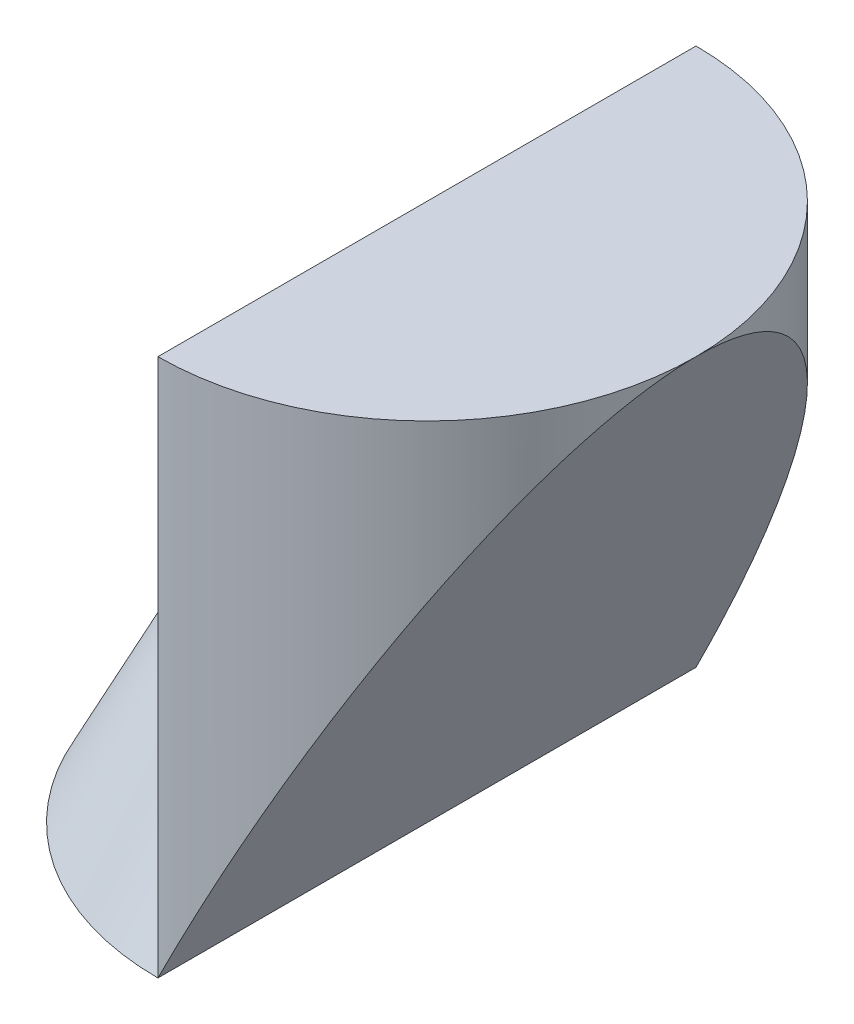
ISO-10303-21;
HEADER;
FILE_DESCRIPTION(('STEP AP214'),'2;1');
FILE_NAME('part.step','',(''),(''),'','','');
FILE_SCHEMA(('AUTOMOTIVE_DESIGN { 1 0 10303 214 1 1 1 1 }'));
ENDSEC;
DATA;
#1=APPLICATION_CONTEXT('core data for automotive mechanical design processes');
#2=APPLICATION_PROTOCOL_DEFINITION('international standard','automotive_design',2000,#1);
#3=PRODUCT_CONTEXT('',#1,'mechanical');
#4=PRODUCT('Part','Part','',(#3));
#5=PRODUCT_RELATED_PRODUCT_CATEGORY('part','',(#4));
#6=PRODUCT_DEFINITION_FORMATION('','',#4);
#7=PRODUCT_DEFINITION_CONTEXT('part definition',#1,'design');
#8=PRODUCT_DEFINITION('design','',#6,#7);
#9=PRODUCT_DEFINITION_SHAPE('','',#8);
#10=(LENGTH_UNIT() NAMED_UNIT(*) SI_UNIT(.MILLI.,.METRE.));
#11=(NAMED_UNIT(*) PLANE_ANGLE_UNIT() SI_UNIT($,.RADIAN.));
#12=(NAMED_UNIT(*) SI_UNIT($,.STERADIAN.) SOLID_ANGLE_UNIT());
#13=UNCERTAINTY_MEASURE_WITH_UNIT(LENGTH_MEASURE(1.E-05),#10,'distance_accuracy_value','');
#14=(GEOMETRIC_REPRESENTATION_CONTEXT(3) GLOBAL_UNCERTAINTY_ASSIGNED_CONTEXT((#13)) GLOBAL_UNIT_ASSIGNED_CONTEXT((#10,
#11,#12)) REPRESENTATION_CONTEXT('',''));
#15=CARTESIAN_POINT('',(0.,0.,0.));
#16=DIRECTION('',(0.,0.,1.));
#17=DIRECTION('',(1.,0.,0.));
#18=AXIS2_PLACEMENT_3D('',#15,#16,#17);
#19=CARTESIAN_POINT('',(2.,4.,2.));
#20=DIRECTION('',(0.,-1.,0.));
#21=DIRECTION('',(0.,0.,-1.));
#22=AXIS2_PLACEMENT_3D('',#19,#20,#21);
#23=CYLINDRICAL_SURFACE('',#22,2.);
#24=DIRECTION('',(0.,-1.,0.));
#25=VECTOR('',#24,1.);
#26=CARTESIAN_POINT('',(2.,4.,4.));
#27=LINE('',#26,#25);
#28=CARTESIAN_POINT('',(2.,4.,4.));
#29=VERTEX_POINT('',#28);
#30=CARTESIAN_POINT('',(2.,0.,4.));
#31=VERTEX_POINT('',#30);
#32=EDGE_CURVE('E59',#29,#31,#27,.T.);
#33=ORIENTED_EDGE('',*,*,#32,.T.);
#34=CARTESIAN_POINT('',(2.,0.,2.));
#35=DIRECTION('',(-0.894427190999916,0.447213595499958,0.));
#36=DIRECTION('',(-0.447213595499958,-0.894427190999916,0.));
#37=AXIS2_PLACEMENT_3D('',#34,#35,#36);
#38=ELLIPSE('',#37,4.47213595499958,2.);
#39=CARTESIAN_POINT('',(4.,4.,2.));
#40=VERTEX_POINT('',#39);
#41=EDGE_CURVE('E92',#31,#40,#38,.T.);
#42=ORIENTED_EDGE('',*,*,#41,.T.);
#43=CARTESIAN_POINT('',(2.,4.,2.));
#44=DIRECTION('',(0.,1.,0.));
#45=DIRECTION('',(0.,0.,-1.));
#46=AXIS2_PLACEMENT_3D('',#43,#44,#45);
#47=CIRCLE('',#46,2.);
#48=EDGE_CURVE('E116',#29,#40,#47,.T.);
#49=ORIENTED_EDGE('',*,*,#48,.F.);
#50=EDGE_LOOP('',(#33,#42,#49));
#51=FACE_BOUND('',#50,.T.);
#52=ADVANCED_FACE('F51',(#51),#23,.T.);
#53=CARTESIAN_POINT('',(2.,4.,0.));
#54=DIRECTION('',(1.,0.,0.));
#55=DIRECTION('',(0.,0.,-1.));
#56=AXIS2_PLACEMENT_3D('',#53,#54,#55);
#57=PLANE('',#56);
#58=DIRECTION('',(0.,0.894427190999916,-0.447213595499958));
#59=VECTOR('',#58,1.);
#60=CARTESIAN_POINT('',(2.,4.,2.));
#61=LINE('',#60,#59);
#62=CARTESIAN_POINT('',(2.,4.,2.));
#63=VERTEX_POINT('',#62);
#64=EDGE_CURVE('E112',#31,#63,#61,.T.);
#65=ORIENTED_EDGE('',*,*,#64,.F.);
#66=ORIENTED_EDGE('',*,*,#32,.F.);
#67=DIRECTION('',(0.,0.,1.));
#68=VECTOR('',#67,1.);
#69=CARTESIAN_POINT('',(2.,4.,0.));
#70=LINE('',#69,#68);
#71=EDGE_CURVE('E72',#63,#29,#70,.T.);
#72=ORIENTED_EDGE('',*,*,#71,.F.);
#73=EDGE_LOOP('',(#65,#66,#72));
#74=FACE_BOUND('',#73,.T.);
#75=ADVANCED_FACE('F121',(#74),#57,.F.);
#76=DIRECTION('',(0.,0.894427190999916,0.447213595499958));
#77=VECTOR('',#76,1.);
#78=CARTESIAN_POINT('',(2.,4.,2.));
#79=LINE('',#78,#77);
#80=CARTESIAN_POINT('',(2.,0.,0.));
#81=VERTEX_POINT('',#80);
#82=EDGE_CURVE('E65',#81,#63,#79,.T.);
#83=ORIENTED_EDGE('',*,*,#82,.T.);
#84=CARTESIAN_POINT('',(2.,4.,0.));
#85=VERTEX_POINT('',#84);
#86=EDGE_CURVE('E103',#85,#63,#70,.T.);
#87=ORIENTED_EDGE('',*,*,#86,.F.);
#88=DIRECTION('',(0.,-1.,0.));
#89=VECTOR('',#88,1.);
#90=CARTESIAN_POINT('',(2.,4.,0.));
#91=LINE('',#90,#89);
#92=EDGE_CURVE('E12',#85,#81,#91,.T.);
#93=ORIENTED_EDGE('',*,*,#92,.T.);
#94=EDGE_LOOP('',(#83,#87,#93));
#95=FACE_BOUND('',#94,.T.);
#96=ADVANCED_FACE('F102',(#95),#57,.F.);
#97=EDGE_CURVE('E100',#40,#85,#47,.T.);
#98=ORIENTED_EDGE('',*,*,#97,.F.);
#99=EDGE_CURVE('E90',#40,#81,#38,.T.);
#100=ORIENTED_EDGE('',*,*,#99,.T.);
#101=ORIENTED_EDGE('',*,*,#92,.F.);
#102=EDGE_LOOP('',(#98,#100,#101));
#103=FACE_BOUND('',#102,.T.);
#104=ADVANCED_FACE('F53',(#103),#23,.T.);
#105=CARTESIAN_POINT('',(2.,4.,2.));
#106=DIRECTION('',(0.,-1.,0.));
#107=DIRECTION('',(0.,0.,-1.));
#108=AXIS2_PLACEMENT_3D('',#105,#106,#107);
#109=PLANE('',#108);
#110=ORIENTED_EDGE('',*,*,#48,.T.);
#111=ORIENTED_EDGE('',*,*,#97,.T.);
#112=ORIENTED_EDGE('',*,*,#86,.T.);
#113=ORIENTED_EDGE('',*,*,#71,.T.);
#114=EDGE_LOOP('',(#110,#111,#112,#113));
#115=FACE_BOUND('',#114,.T.);
#116=ADVANCED_FACE('F122',(#115),#109,.F.);
#117=CARTESIAN_POINT('',(2.,0.,2.));
#118=DIRECTION('',(0.,-1.,0.));
#119=DIRECTION('',(0.,0.,-1.));
#120=AXIS2_PLACEMENT_3D('',#117,#118,#119);
#121=PLANE('',#120);
#122=DIRECTION('',(0.,0.,-1.));
#123=VECTOR('',#122,1.);
#124=CARTESIAN_POINT('',(2.,0.,4.));
#125=LINE('',#124,#123);
#126=EDGE_CURVE('E87',#31,#81,#125,.T.);
#127=ORIENTED_EDGE('',*,*,#126,.F.);
#128=CARTESIAN_POINT('',(2.,0.,2.));
#129=DIRECTION('',(0.,1.,0.));
#130=DIRECTION('',(0.,0.,1.));
#131=AXIS2_PLACEMENT_3D('',#128,#129,#130);
#132=CIRCLE('',#131,2.);
#133=EDGE_CURVE('E105',#81,#31,#132,.T.);
#134=ORIENTED_EDGE('',*,*,#133,.F.);
#135=EDGE_LOOP('',(#127,#134));
#136=FACE_BOUND('',#135,.T.);
#137=ADVANCED_FACE('F106',(#136),#121,.T.);
#138=CARTESIAN_POINT('',(2.,0.,2.));
#139=DIRECTION('',(0.,-1.,0.));
#140=DIRECTION('',(0.,0.,-1.));
#141=AXIS2_PLACEMENT_3D('',#138,#139,#140);
#142=CONICAL_SURFACE('',#141,2.,0.463647609000806);
#143=ORIENTED_EDGE('',*,*,#133,.T.);
#144=ORIENTED_EDGE('',*,*,#64,.T.);
#145=ORIENTED_EDGE('',*,*,#82,.F.);
#146=EDGE_LOOP('',(#143,#144,#145));
#147=FACE_BOUND('',#146,.T.);
#148=ADVANCED_FACE('F110',(#147),#142,.T.);
#149=CARTESIAN_POINT('',(1.6,-0.8,4.));
#150=DIRECTION('',(-0.894427190999916,0.447213595499958,0.));
#151=DIRECTION('',(-0.447213595499958,-0.894427190999916,0.));
#152=AXIS2_PLACEMENT_3D('',#149,#150,#151);
#153=PLANE('',#152);
#154=ORIENTED_EDGE('',*,*,#126,.T.);
#155=ORIENTED_EDGE('',*,*,#99,.F.);
#156=ORIENTED_EDGE('',*,*,#41,.F.);
#157=EDGE_LOOP('',(#154,#155,#156));
#158=FACE_BOUND('',#157,.T.);
#159=ADVANCED_FACE('F89',(#158),#153,.F.);
#160=CLOSED_SHELL('',(#52,#75,#96,#104,#116,#137,#148,#159));
#161=MANIFOLD_SOLID_BREP('B2',#160);
#162=ADVANCED_BREP_SHAPE_REPRESENTATION('',(#18,#161),#14);
#163=SHAPE_DEFINITION_REPRESENTATION(#9,#162);
ENDSEC;
END-ISO-10303-21;
